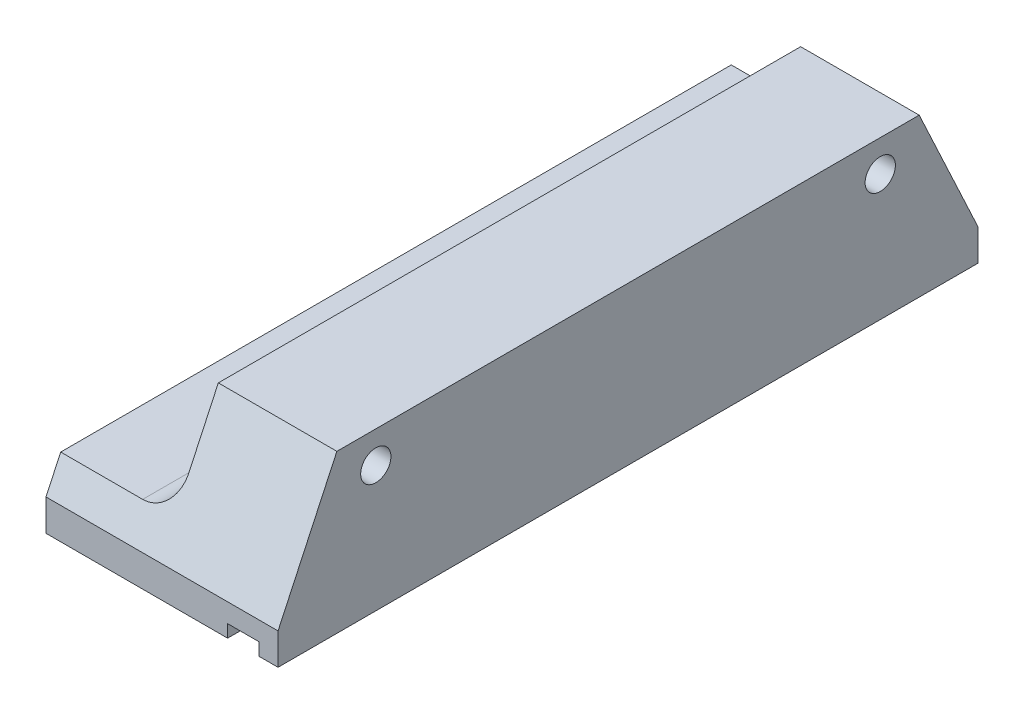
ISO-10303-21;
HEADER;
FILE_DESCRIPTION(('STEP AP214'),'2;1');
FILE_NAME('part.step','',(''),(''),'','','');
FILE_SCHEMA(('AUTOMOTIVE_DESIGN { 1 0 10303 214 1 1 1 1 }'));
ENDSEC;
DATA;
#1=APPLICATION_CONTEXT('core data for automotive mechanical design processes');
#2=APPLICATION_PROTOCOL_DEFINITION('international standard','automotive_design',2000,#1);
#3=PRODUCT_CONTEXT('',#1,'mechanical');
#4=PRODUCT('Part','Part','',(#3));
#5=PRODUCT_RELATED_PRODUCT_CATEGORY('part','',(#4));
#6=PRODUCT_DEFINITION_FORMATION('','',#4);
#7=PRODUCT_DEFINITION_CONTEXT('part definition',#1,'design');
#8=PRODUCT_DEFINITION('design','',#6,#7);
#9=PRODUCT_DEFINITION_SHAPE('','',#8);
#10=(LENGTH_UNIT() NAMED_UNIT(*) SI_UNIT(.MILLI.,.METRE.));
#11=(NAMED_UNIT(*) PLANE_ANGLE_UNIT() SI_UNIT($,.RADIAN.));
#12=(NAMED_UNIT(*) SI_UNIT($,.STERADIAN.) SOLID_ANGLE_UNIT());
#13=UNCERTAINTY_MEASURE_WITH_UNIT(LENGTH_MEASURE(1.E-05),#10,'distance_accuracy_value','');
#14=(GEOMETRIC_REPRESENTATION_CONTEXT(3) GLOBAL_UNCERTAINTY_ASSIGNED_CONTEXT((#13)) GLOBAL_UNIT_ASSIGNED_CONTEXT((#10,
#11,#12)) REPRESENTATION_CONTEXT('',''));
#15=CARTESIAN_POINT('',(0.,0.,0.));
#16=DIRECTION('',(0.,0.,1.));
#17=DIRECTION('',(1.,0.,0.));
#18=AXIS2_PLACEMENT_3D('',#15,#16,#17);
#19=CARTESIAN_POINT('',(0.,12.5,55.5));
#20=DIRECTION('',(0.,-1.,0.));
#21=DIRECTION('',(1.,0.,0.));
#22=AXIS2_PLACEMENT_3D('',#19,#20,#21);
#23=PLANE('',#22);
#24=DIRECTION('',(0.,0.,-1.));
#25=VECTOR('',#24,1.);
#26=CARTESIAN_POINT('',(-9.4,12.5,0.));
#27=LINE('',#26,#25);
#28=CARTESIAN_POINT('',(-9.4,12.5,50.83692341845));
#29=VERTEX_POINT('',#28);
#30=CARTESIAN_POINT('',(-9.4,12.5,4.66307658154998));
#31=VERTEX_POINT('',#30);
#32=EDGE_CURVE('E152',#29,#31,#27,.T.);
#33=ORIENTED_EDGE('',*,*,#32,.F.);
#34=DIRECTION('',(1.,0.,0.));
#35=VECTOR('',#34,1.);
#36=CARTESIAN_POINT('',(0.,12.5,50.83692341845));
#37=LINE('',#36,#35);
#38=CARTESIAN_POINT('',(0.,12.5,50.83692341845));
#39=VERTEX_POINT('',#38);
#40=EDGE_CURVE('E173',#29,#39,#37,.T.);
#41=ORIENTED_EDGE('',*,*,#40,.T.);
#42=DIRECTION('',(0.,0.,-1.));
#43=VECTOR('',#42,1.);
#44=CARTESIAN_POINT('',(0.,12.5,55.5));
#45=LINE('',#44,#43);
#46=CARTESIAN_POINT('',(0.,12.5,4.66307658154998));
#47=VERTEX_POINT('',#46);
#48=EDGE_CURVE('E163',#39,#47,#45,.T.);
#49=ORIENTED_EDGE('',*,*,#48,.T.);
#50=DIRECTION('',(-1.,0.,0.));
#51=VECTOR('',#50,1.);
#52=CARTESIAN_POINT('',(0.,12.5,4.66307658154998));
#53=LINE('',#52,#51);
#54=EDGE_CURVE('E158',#47,#31,#53,.T.);
#55=ORIENTED_EDGE('',*,*,#54,.T.);
#56=EDGE_LOOP('',(#33,#41,#49,#55));
#57=FACE_BOUND('',#56,.T.);
#58=ADVANCED_FACE('F35',(#57),#23,.F.);
#59=CARTESIAN_POINT('',(-18.4,9.99999999999999,7.75));
#60=DIRECTION('',(-1.,0.,0.));
#61=DIRECTION('',(0.,0.,1.));
#62=AXIS2_PLACEMENT_3D('',#59,#60,#61);
#63=CYLINDRICAL_SURFACE('',#62,2.19999999999999);
#64=CARTESIAN_POINT('',(-7.5,9.99999999999999,7.75));
#65=DIRECTION('',(-1.,0.,0.));
#66=DIRECTION('',(0.,0.,1.));
#67=AXIS2_PLACEMENT_3D('',#64,#65,#66);
#68=CIRCLE('',#67,2.2);
#69=CARTESIAN_POINT('',(-7.5,9.99999999999999,9.95));
#70=VERTEX_POINT('',#69);
#71=EDGE_CURVE('E296',#70,#70,#68,.T.);
#72=ORIENTED_EDGE('',*,*,#71,.F.);
#73=EDGE_LOOP('',(#72));
#74=FACE_BOUND('',#73,.T.);
#75=CARTESIAN_POINT('',(-9.4,9.99999999999999,7.75));
#76=DIRECTION('',(-1.,0.,0.));
#77=DIRECTION('',(0.,0.,1.));
#78=AXIS2_PLACEMENT_3D('',#75,#76,#77);
#79=CIRCLE('',#78,2.19999999999999);
#80=CARTESIAN_POINT('',(-9.4,9.99999999999999,9.94999999999999));
#81=VERTEX_POINT('',#80);
#82=EDGE_CURVE('E143',#81,#81,#79,.F.);
#83=ORIENTED_EDGE('',*,*,#82,.F.);
#84=EDGE_LOOP('',(#83));
#85=FACE_BOUND('',#84,.T.);
#86=ADVANCED_FACE('F319',(#74,#85),#63,.F.);
#87=CARTESIAN_POINT('',(-18.4,9.99999999999999,47.75));
#88=DIRECTION('',(-1.,0.,0.));
#89=DIRECTION('',(0.,0.,1.));
#90=AXIS2_PLACEMENT_3D('',#87,#88,#89);
#91=CYLINDRICAL_SURFACE('',#90,2.19999999999999);
#92=CARTESIAN_POINT('',(-7.5,9.99999999999999,47.75));
#93=DIRECTION('',(-1.,0.,0.));
#94=DIRECTION('',(0.,0.,1.));
#95=AXIS2_PLACEMENT_3D('',#92,#93,#94);
#96=CIRCLE('',#95,2.2);
#97=CARTESIAN_POINT('',(-7.5,9.99999999999999,49.95));
#98=VERTEX_POINT('',#97);
#99=EDGE_CURVE('E142',#98,#98,#96,.T.);
#100=ORIENTED_EDGE('',*,*,#99,.F.);
#101=EDGE_LOOP('',(#100));
#102=FACE_BOUND('',#101,.T.);
#103=CARTESIAN_POINT('',(-9.4,9.99999999999999,47.75));
#104=DIRECTION('',(-1.,0.,0.));
#105=DIRECTION('',(0.,0.,1.));
#106=AXIS2_PLACEMENT_3D('',#103,#104,#105);
#107=CIRCLE('',#106,2.19999999999999);
#108=CARTESIAN_POINT('',(-9.4,9.99999999999999,49.95));
#109=VERTEX_POINT('',#108);
#110=EDGE_CURVE('E309',#109,#109,#107,.F.);
#111=ORIENTED_EDGE('',*,*,#110,.F.);
#112=EDGE_LOOP('',(#111));
#113=FACE_BOUND('',#112,.T.);
#114=ADVANCED_FACE('F324',(#102,#113),#91,.F.);
#115=CARTESIAN_POINT('',(0.,0.,55.5));
#116=DIRECTION('',(0.,1.,0.));
#117=DIRECTION('',(-1.,0.,0.));
#118=AXIS2_PLACEMENT_3D('',#115,#116,#117);
#119=PLANE('',#118);
#120=DIRECTION('',(1.,0.,0.));
#121=VECTOR('',#120,1.);
#122=CARTESIAN_POINT('',(0.,0.,55.5));
#123=LINE('',#122,#121);
#124=CARTESIAN_POINT('',(-1.5,0.,55.5));
#125=VERTEX_POINT('',#124);
#126=CARTESIAN_POINT('',(0.,0.,55.5));
#127=VERTEX_POINT('',#126);
#128=EDGE_CURVE('E225',#125,#127,#123,.T.);
#129=ORIENTED_EDGE('',*,*,#128,.F.);
#130=DIRECTION('',(0.,0.,1.));
#131=VECTOR('',#130,1.);
#132=CARTESIAN_POINT('',(-1.5,0.,0.));
#133=LINE('',#132,#131);
#134=CARTESIAN_POINT('',(-1.5,0.,0.));
#135=VERTEX_POINT('',#134);
#136=EDGE_CURVE('E222',#135,#125,#133,.T.);
#137=ORIENTED_EDGE('',*,*,#136,.F.);
#138=DIRECTION('',(1.,0.,0.));
#139=VECTOR('',#138,1.);
#140=CARTESIAN_POINT('',(0.,0.,0.));
#141=LINE('',#140,#139);
#142=CARTESIAN_POINT('',(0.,0.,0.));
#143=VERTEX_POINT('',#142);
#144=EDGE_CURVE('E217',#135,#143,#141,.T.);
#145=ORIENTED_EDGE('',*,*,#144,.T.);
#146=DIRECTION('',(0.,0.,-1.));
#147=VECTOR('',#146,1.);
#148=CARTESIAN_POINT('',(0.,0.,55.5));
#149=LINE('',#148,#147);
#150=EDGE_CURVE('E207',#127,#143,#149,.T.);
#151=ORIENTED_EDGE('',*,*,#150,.F.);
#152=EDGE_LOOP('',(#129,#137,#145,#151));
#153=FACE_BOUND('',#152,.T.);
#154=ADVANCED_FACE('F332',(#153),#119,.F.);
#155=CARTESIAN_POINT('',(0.,0.,55.5));
#156=DIRECTION('',(-1.,0.,0.));
#157=DIRECTION('',(0.,0.,1.));
#158=AXIS2_PLACEMENT_3D('',#155,#156,#157);
#159=PLANE('',#158);
#160=CARTESIAN_POINT('',(0.,9.99999999999999,47.75));
#161=DIRECTION('',(-1.,0.,0.));
#162=DIRECTION('',(0.,0.,1.));
#163=AXIS2_PLACEMENT_3D('',#160,#161,#162);
#164=CIRCLE('',#163,1.2);
#165=CARTESIAN_POINT('',(0.,9.99999999999999,48.95));
#166=VERTEX_POINT('',#165);
#167=EDGE_CURVE('E299',#166,#166,#164,.T.);
#168=ORIENTED_EDGE('',*,*,#167,.T.);
#169=EDGE_LOOP('',(#168));
#170=FACE_BOUND('',#169,.T.);
#171=CARTESIAN_POINT('',(0.,9.99999999999999,7.75));
#172=DIRECTION('',(-1.,0.,0.));
#173=DIRECTION('',(0.,0.,1.));
#174=AXIS2_PLACEMENT_3D('',#171,#172,#173);
#175=CIRCLE('',#174,1.2);
#176=CARTESIAN_POINT('',(0.,9.99999999999999,8.95));
#177=VERTEX_POINT('',#176);
#178=EDGE_CURVE('E290',#177,#177,#175,.T.);
#179=ORIENTED_EDGE('',*,*,#178,.T.);
#180=EDGE_LOOP('',(#179));
#181=FACE_BOUND('',#180,.T.);
#182=ORIENTED_EDGE('',*,*,#48,.F.);
#183=DIRECTION('',(0.,-0.906307787036651,0.422618261740697));
#184=VECTOR('',#183,1.);
#185=CARTESIAN_POINT('',(0.,2.49999999999993,55.5));
#186=LINE('',#185,#184);
#187=CARTESIAN_POINT('',(0.,2.49999999999993,55.5));
#188=VERTEX_POINT('',#187);
#189=EDGE_CURVE('E175',#39,#188,#186,.T.);
#190=ORIENTED_EDGE('',*,*,#189,.T.);
#191=DIRECTION('',(0.,1.,0.));
#192=VECTOR('',#191,1.);
#193=CARTESIAN_POINT('',(0.,0.,55.5));
#194=LINE('',#193,#192);
#195=EDGE_CURVE('E216',#127,#188,#194,.T.);
#196=ORIENTED_EDGE('',*,*,#195,.F.);
#197=ORIENTED_EDGE('',*,*,#150,.T.);
#198=DIRECTION('',(0.,1.,0.));
#199=VECTOR('',#198,1.);
#200=CARTESIAN_POINT('',(0.,0.,0.));
#201=LINE('',#200,#199);
#202=CARTESIAN_POINT('',(0.,2.49999999999992,0.));
#203=VERTEX_POINT('',#202);
#204=EDGE_CURVE('E220',#143,#203,#201,.T.);
#205=ORIENTED_EDGE('',*,*,#204,.T.);
#206=DIRECTION('',(0.,-0.906307787036651,-0.422618261740697));
#207=VECTOR('',#206,1.);
#208=CARTESIAN_POINT('',(0.,12.5,4.66307658154998));
#209=LINE('',#208,#207);
#210=EDGE_CURVE('E160',#203,#47,#209,.F.);
#211=ORIENTED_EDGE('',*,*,#210,.T.);
#212=EDGE_LOOP('',(#182,#190,#196,#197,#205,#211));
#213=FACE_BOUND('',#212,.T.);
#214=ADVANCED_FACE('F200',(#170,#181,#213),#159,.F.);
#215=CARTESIAN_POINT('',(-18.4,0.,55.5));
#216=DIRECTION('',(1.,0.,0.));
#217=DIRECTION('',(0.,0.,-1.));
#218=AXIS2_PLACEMENT_3D('',#215,#216,#217);
#219=PLANE('',#218);
#220=CARTESIAN_POINT('',(-18.4,3.,51.75));
#221=DIRECTION('',(-1.,0.,0.));
#222=DIRECTION('',(0.,0.,1.));
#223=AXIS2_PLACEMENT_3D('',#220,#221,#222);
#224=CIRCLE('',#223,1.);
#225=CARTESIAN_POINT('',(-18.4,3.,52.75));
#226=VERTEX_POINT('',#225);
#227=EDGE_CURVE('E287',#226,#226,#224,.T.);
#228=ORIENTED_EDGE('',*,*,#227,.F.);
#229=EDGE_LOOP('',(#228));
#230=FACE_BOUND('',#229,.T.);
#231=CARTESIAN_POINT('',(-18.4,3.,27.75));
#232=DIRECTION('',(-1.,0.,0.));
#233=DIRECTION('',(0.,0.,1.));
#234=AXIS2_PLACEMENT_3D('',#231,#232,#233);
#235=CIRCLE('',#234,1.);
#236=CARTESIAN_POINT('',(-18.4,3.,28.75));
#237=VERTEX_POINT('',#236);
#238=EDGE_CURVE('E275',#237,#237,#235,.T.);
#239=ORIENTED_EDGE('',*,*,#238,.F.);
#240=EDGE_LOOP('',(#239));
#241=FACE_BOUND('',#240,.T.);
#242=CARTESIAN_POINT('',(-18.4,3.,3.75));
#243=DIRECTION('',(-1.,0.,0.));
#244=DIRECTION('',(0.,0.,1.));
#245=AXIS2_PLACEMENT_3D('',#242,#243,#244);
#246=CIRCLE('',#245,0.999999999999999);
#247=CARTESIAN_POINT('',(-18.4,3.,4.75));
#248=VERTEX_POINT('',#247);
#249=EDGE_CURVE('E263',#248,#248,#246,.T.);
#250=ORIENTED_EDGE('',*,*,#249,.F.);
#251=EDGE_LOOP('',(#250));
#252=FACE_BOUND('',#251,.T.);
#253=DIRECTION('',(0.,0.906307787036651,-0.422618261740697));
#254=VECTOR('',#253,1.);
#255=CARTESIAN_POINT('',(-18.4,2.49999999999993,55.5));
#256=LINE('',#255,#254);
#257=CARTESIAN_POINT('',(-18.4,2.49999999999993,55.5));
#258=VERTEX_POINT('',#257);
#259=CARTESIAN_POINT('',(-18.4,5.,54.3342308546125));
#260=VERTEX_POINT('',#259);
#261=EDGE_CURVE('E151',#258,#260,#256,.T.);
#262=ORIENTED_EDGE('',*,*,#261,.T.);
#263=DIRECTION('',(0.,0.,1.));
#264=VECTOR('',#263,1.);
#265=CARTESIAN_POINT('',(-18.4,4.99999999999999,0.));
#266=LINE('',#265,#264);
#267=CARTESIAN_POINT('',(-18.4,4.99999999999999,1.16576914538752));
#268=VERTEX_POINT('',#267);
#269=EDGE_CURVE('E138',#268,#260,#266,.T.);
#270=ORIENTED_EDGE('',*,*,#269,.F.);
#271=DIRECTION('',(0.,0.906307787036651,0.422618261740697));
#272=VECTOR('',#271,1.);
#273=CARTESIAN_POINT('',(-18.4,12.5,4.66307658154998));
#274=LINE('',#273,#272);
#275=CARTESIAN_POINT('',(-18.4,2.49999999999992,0.));
#276=VERTEX_POINT('',#275);
#277=EDGE_CURVE('E148',#268,#276,#274,.F.);
#278=ORIENTED_EDGE('',*,*,#277,.T.);
#279=DIRECTION('',(0.,-1.,0.));
#280=VECTOR('',#279,1.);
#281=CARTESIAN_POINT('',(-18.4,0.,0.));
#282=LINE('',#281,#280);
#283=CARTESIAN_POINT('',(-18.4,0.,0.));
#284=VERTEX_POINT('',#283);
#285=EDGE_CURVE('E218',#276,#284,#282,.T.);
#286=ORIENTED_EDGE('',*,*,#285,.T.);
#287=DIRECTION('',(0.,0.,-1.));
#288=VECTOR('',#287,1.);
#289=CARTESIAN_POINT('',(-18.4,0.,55.5));
#290=LINE('',#289,#288);
#291=CARTESIAN_POINT('',(-18.4,0.,55.5));
#292=VERTEX_POINT('',#291);
#293=EDGE_CURVE('E205',#292,#284,#290,.T.);
#294=ORIENTED_EDGE('',*,*,#293,.F.);
#295=DIRECTION('',(0.,-1.,0.));
#296=VECTOR('',#295,1.);
#297=CARTESIAN_POINT('',(-18.4,0.,55.5));
#298=LINE('',#297,#296);
#299=EDGE_CURVE('E226',#258,#292,#298,.T.);
#300=ORIENTED_EDGE('',*,*,#299,.F.);
#301=EDGE_LOOP('',(#262,#270,#278,#286,#294,#300));
#302=FACE_BOUND('',#301,.T.);
#303=ADVANCED_FACE('F147',(#230,#241,#252,#302),#219,.F.);
#304=CARTESIAN_POINT('',(-4.,0.,0.));
#305=VERTEX_POINT('',#304);
#306=EDGE_CURVE('E213',#284,#305,#141,.T.);
#307=ORIENTED_EDGE('',*,*,#306,.T.);
#308=DIRECTION('',(0.,0.,1.));
#309=VECTOR('',#308,1.);
#310=CARTESIAN_POINT('',(-4.,0.,0.));
#311=LINE('',#310,#309);
#312=CARTESIAN_POINT('',(-4.,0.,55.5));
#313=VERTEX_POINT('',#312);
#314=EDGE_CURVE('E234',#305,#313,#311,.T.);
#315=ORIENTED_EDGE('',*,*,#314,.T.);
#316=EDGE_CURVE('E212',#292,#313,#123,.T.);
#317=ORIENTED_EDGE('',*,*,#316,.F.);
#318=ORIENTED_EDGE('',*,*,#293,.T.);
#319=EDGE_LOOP('',(#307,#315,#317,#318));
#320=FACE_BOUND('',#319,.T.);
#321=ADVANCED_FACE('F427',(#320),#119,.F.);
#322=CARTESIAN_POINT('',(0.,0.,55.5));
#323=DIRECTION('',(0.,0.,1.));
#324=DIRECTION('',(1.,0.,0.));
#325=AXIS2_PLACEMENT_3D('',#322,#323,#324);
#326=PLANE('',#325);
#327=ORIENTED_EDGE('',*,*,#195,.T.);
#328=DIRECTION('',(-1.,0.,0.));
#329=VECTOR('',#328,1.);
#330=CARTESIAN_POINT('',(-18.4,2.49999999999993,55.5));
#331=LINE('',#330,#329);
#332=EDGE_CURVE('E169',#188,#258,#331,.T.);
#333=ORIENTED_EDGE('',*,*,#332,.T.);
#334=ORIENTED_EDGE('',*,*,#299,.T.);
#335=ORIENTED_EDGE('',*,*,#316,.T.);
#336=DIRECTION('',(0.,-1.,0.));
#337=VECTOR('',#336,1.);
#338=CARTESIAN_POINT('',(-4.,0.,55.5));
#339=LINE('',#338,#337);
#340=CARTESIAN_POINT('',(-4.,1.,55.5));
#341=VERTEX_POINT('',#340);
#342=EDGE_CURVE('E238',#341,#313,#339,.T.);
#343=ORIENTED_EDGE('',*,*,#342,.F.);
#344=DIRECTION('',(-1.,0.,0.));
#345=VECTOR('',#344,1.);
#346=CARTESIAN_POINT('',(-1.5,1.,55.5));
#347=LINE('',#346,#345);
#348=CARTESIAN_POINT('',(-1.5,1.,55.5));
#349=VERTEX_POINT('',#348);
#350=EDGE_CURVE('E241',#349,#341,#347,.T.);
#351=ORIENTED_EDGE('',*,*,#350,.F.);
#352=DIRECTION('',(0.,1.,0.));
#353=VECTOR('',#352,1.);
#354=CARTESIAN_POINT('',(-1.5,0.,55.5));
#355=LINE('',#354,#353);
#356=EDGE_CURVE('E244',#125,#349,#355,.T.);
#357=ORIENTED_EDGE('',*,*,#356,.F.);
#358=ORIENTED_EDGE('',*,*,#128,.T.);
#359=EDGE_LOOP('',(#327,#333,#334,#335,#343,#351,#357,#358));
#360=FACE_BOUND('',#359,.T.);
#361=ADVANCED_FACE('F424',(#360),#326,.T.);
#362=CARTESIAN_POINT('',(0.,0.,0.));
#363=DIRECTION('',(0.,0.,1.));
#364=DIRECTION('',(1.,0.,0.));
#365=AXIS2_PLACEMENT_3D('',#362,#363,#364);
#366=PLANE('',#365);
#367=ORIENTED_EDGE('',*,*,#285,.F.);
#368=DIRECTION('',(1.,0.,0.));
#369=VECTOR('',#368,1.);
#370=CARTESIAN_POINT('',(0.,2.49999999999992,0.));
#371=LINE('',#370,#369);
#372=EDGE_CURVE('E157',#276,#203,#371,.T.);
#373=ORIENTED_EDGE('',*,*,#372,.T.);
#374=ORIENTED_EDGE('',*,*,#204,.F.);
#375=ORIENTED_EDGE('',*,*,#144,.F.);
#376=DIRECTION('',(0.,1.,0.));
#377=VECTOR('',#376,1.);
#378=CARTESIAN_POINT('',(-1.5,0.,0.));
#379=LINE('',#378,#377);
#380=CARTESIAN_POINT('',(-1.5,1.,0.));
#381=VERTEX_POINT('',#380);
#382=EDGE_CURVE('E240',#135,#381,#379,.T.);
#383=ORIENTED_EDGE('',*,*,#382,.T.);
#384=DIRECTION('',(-1.,0.,0.));
#385=VECTOR('',#384,1.);
#386=CARTESIAN_POINT('',(-1.5,1.,0.));
#387=LINE('',#386,#385);
#388=CARTESIAN_POINT('',(-4.,1.,0.));
#389=VERTEX_POINT('',#388);
#390=EDGE_CURVE('E250',#381,#389,#387,.T.);
#391=ORIENTED_EDGE('',*,*,#390,.T.);
#392=DIRECTION('',(0.,-1.,0.));
#393=VECTOR('',#392,1.);
#394=CARTESIAN_POINT('',(-4.,0.,0.));
#395=LINE('',#394,#393);
#396=EDGE_CURVE('E232',#389,#305,#395,.T.);
#397=ORIENTED_EDGE('',*,*,#396,.T.);
#398=ORIENTED_EDGE('',*,*,#306,.F.);
#399=EDGE_LOOP('',(#367,#373,#374,#375,#383,#391,#397,#398));
#400=FACE_BOUND('',#399,.T.);
#401=ADVANCED_FACE('F422',(#400),#366,.F.);
#402=CARTESIAN_POINT('',(-1.5,0.,0.));
#403=DIRECTION('',(1.,0.,0.));
#404=DIRECTION('',(0.,1.,0.));
#405=AXIS2_PLACEMENT_3D('',#402,#403,#404);
#406=PLANE('',#405);
#407=ORIENTED_EDGE('',*,*,#356,.T.);
#408=DIRECTION('',(0.,0.,1.));
#409=VECTOR('',#408,1.);
#410=CARTESIAN_POINT('',(-1.5,1.,0.));
#411=LINE('',#410,#409);
#412=EDGE_CURVE('E229',#381,#349,#411,.T.);
#413=ORIENTED_EDGE('',*,*,#412,.F.);
#414=ORIENTED_EDGE('',*,*,#382,.F.);
#415=ORIENTED_EDGE('',*,*,#136,.T.);
#416=EDGE_LOOP('',(#407,#413,#414,#415));
#417=FACE_BOUND('',#416,.T.);
#418=ADVANCED_FACE('F415',(#417),#406,.F.);
#419=CARTESIAN_POINT('',(-4.,0.,0.));
#420=DIRECTION('',(-1.,0.,0.));
#421=DIRECTION('',(0.,0.,1.));
#422=AXIS2_PLACEMENT_3D('',#419,#420,#421);
#423=PLANE('',#422);
#424=ORIENTED_EDGE('',*,*,#342,.T.);
#425=ORIENTED_EDGE('',*,*,#314,.F.);
#426=ORIENTED_EDGE('',*,*,#396,.F.);
#427=DIRECTION('',(0.,0.,1.));
#428=VECTOR('',#427,1.);
#429=CARTESIAN_POINT('',(-4.,1.,0.));
#430=LINE('',#429,#428);
#431=EDGE_CURVE('E231',#389,#341,#430,.T.);
#432=ORIENTED_EDGE('',*,*,#431,.T.);
#433=EDGE_LOOP('',(#424,#425,#426,#432));
#434=FACE_BOUND('',#433,.T.);
#435=ADVANCED_FACE('F412',(#434),#423,.F.);
#436=CARTESIAN_POINT('',(-1.5,1.,0.));
#437=DIRECTION('',(0.,1.,0.));
#438=DIRECTION('',(-1.,0.,0.));
#439=AXIS2_PLACEMENT_3D('',#436,#437,#438);
#440=PLANE('',#439);
#441=ORIENTED_EDGE('',*,*,#350,.T.);
#442=ORIENTED_EDGE('',*,*,#431,.F.);
#443=ORIENTED_EDGE('',*,*,#390,.F.);
#444=ORIENTED_EDGE('',*,*,#412,.T.);
#445=EDGE_LOOP('',(#441,#442,#443,#444));
#446=FACE_BOUND('',#445,.T.);
#447=ADVANCED_FACE('F410',(#446),#440,.F.);
#448=CARTESIAN_POINT('',(-11.9,3.,3.75));
#449=DIRECTION('',(-1.,0.,0.));
#450=DIRECTION('',(0.,0.,1.));
#451=AXIS2_PLACEMENT_3D('',#448,#449,#450);
#452=CONICAL_SURFACE('',#451,0.799999999999999,1.02974425867665);
#453=CARTESIAN_POINT('',(-11.4193115047779,3.,3.75));
#454=VERTEX_POINT('',#453);
#455=VERTEX_LOOP('',#454);
#456=FACE_BOUND('',#455,.T.);
#457=CARTESIAN_POINT('',(-11.9,3.,3.75));
#458=DIRECTION('',(-1.,0.,0.));
#459=DIRECTION('',(0.,0.,1.));
#460=AXIS2_PLACEMENT_3D('',#457,#458,#459);
#461=CIRCLE('',#460,0.799999999999999);
#462=CARTESIAN_POINT('',(-11.9,3.,4.55));
#463=VERTEX_POINT('',#462);
#464=EDGE_CURVE('E247',#463,#463,#461,.T.);
#465=ORIENTED_EDGE('',*,*,#464,.T.);
#466=EDGE_LOOP('',(#465));
#467=FACE_BOUND('',#466,.T.);
#468=ADVANCED_FACE('F406',(#456,#467),#452,.F.);
#469=CARTESIAN_POINT('',(-18.4,3.,3.75));
#470=DIRECTION('',(-1.,0.,0.));
#471=DIRECTION('',(0.,0.,1.));
#472=AXIS2_PLACEMENT_3D('',#469,#470,#471);
#473=CYLINDRICAL_SURFACE('',#472,0.799999999999999);
#474=ORIENTED_EDGE('',*,*,#464,.F.);
#475=EDGE_LOOP('',(#474));
#476=FACE_BOUND('',#475,.T.);
#477=CARTESIAN_POINT('',(-13.9,3.,3.75));
#478=DIRECTION('',(-1.,0.,0.));
#479=DIRECTION('',(0.,0.,1.));
#480=AXIS2_PLACEMENT_3D('',#477,#478,#479);
#481=CIRCLE('',#480,0.799999999999999);
#482=CARTESIAN_POINT('',(-13.9,3.,4.55));
#483=VERTEX_POINT('',#482);
#484=EDGE_CURVE('E257',#483,#483,#481,.T.);
#485=ORIENTED_EDGE('',*,*,#484,.T.);
#486=EDGE_LOOP('',(#485));
#487=FACE_BOUND('',#486,.T.);
#488=ADVANCED_FACE('F402',(#476,#487),#473,.F.);
#489=CARTESIAN_POINT('',(-13.9,3.8,3.75));
#490=DIRECTION('',(1.,0.,0.));
#491=DIRECTION('',(0.,0.,-1.));
#492=AXIS2_PLACEMENT_3D('',#489,#490,#491);
#493=PLANE('',#492);
#494=ORIENTED_EDGE('',*,*,#484,.F.);
#495=EDGE_LOOP('',(#494));
#496=FACE_BOUND('',#495,.T.);
#497=CARTESIAN_POINT('',(-13.9,3.,3.75));
#498=DIRECTION('',(-1.,0.,0.));
#499=DIRECTION('',(0.,0.,1.));
#500=AXIS2_PLACEMENT_3D('',#497,#498,#499);
#501=CIRCLE('',#500,0.999999999999999);
#502=CARTESIAN_POINT('',(-13.9,3.,4.75));
#503=VERTEX_POINT('',#502);
#504=EDGE_CURVE('E260',#503,#503,#501,.T.);
#505=ORIENTED_EDGE('',*,*,#504,.T.);
#506=EDGE_LOOP('',(#505));
#507=FACE_BOUND('',#506,.T.);
#508=ADVANCED_FACE('F398',(#496,#507),#493,.F.);
#509=CARTESIAN_POINT('',(-18.4,3.,3.75));
#510=DIRECTION('',(-1.,0.,0.));
#511=DIRECTION('',(0.,0.,1.));
#512=AXIS2_PLACEMENT_3D('',#509,#510,#511);
#513=CYLINDRICAL_SURFACE('',#512,0.999999999999999);
#514=ORIENTED_EDGE('',*,*,#504,.F.);
#515=EDGE_LOOP('',(#514));
#516=FACE_BOUND('',#515,.T.);
#517=ORIENTED_EDGE('',*,*,#249,.T.);
#518=EDGE_LOOP('',(#517));
#519=FACE_BOUND('',#518,.T.);
#520=ADVANCED_FACE('F394',(#516,#519),#513,.F.);
#521=CARTESIAN_POINT('',(-11.9,3.,27.75));
#522=DIRECTION('',(-1.,0.,0.));
#523=DIRECTION('',(0.,0.,1.));
#524=AXIS2_PLACEMENT_3D('',#521,#522,#523);
#525=CONICAL_SURFACE('',#524,0.799999999999998,1.02974425867665);
#526=CARTESIAN_POINT('',(-11.4193115047779,3.,27.75));
#527=VERTEX_POINT('',#526);
#528=VERTEX_LOOP('',#527);
#529=FACE_BOUND('',#528,.T.);
#530=CARTESIAN_POINT('',(-11.9,3.,27.75));
#531=DIRECTION('',(-1.,0.,0.));
#532=DIRECTION('',(0.,0.,1.));
#533=AXIS2_PLACEMENT_3D('',#530,#531,#532);
#534=CIRCLE('',#533,0.799999999999998);
#535=CARTESIAN_POINT('',(-11.9,3.,28.55));
#536=VERTEX_POINT('',#535);
#537=EDGE_CURVE('E266',#536,#536,#534,.T.);
#538=ORIENTED_EDGE('',*,*,#537,.T.);
#539=EDGE_LOOP('',(#538));
#540=FACE_BOUND('',#539,.T.);
#541=ADVANCED_FACE('F390',(#529,#540),#525,.F.);
#542=CARTESIAN_POINT('',(-18.4,3.,27.75));
#543=DIRECTION('',(-1.,0.,0.));
#544=DIRECTION('',(0.,0.,1.));
#545=AXIS2_PLACEMENT_3D('',#542,#543,#544);
#546=CYLINDRICAL_SURFACE('',#545,0.799999999999998);
#547=ORIENTED_EDGE('',*,*,#537,.F.);
#548=EDGE_LOOP('',(#547));
#549=FACE_BOUND('',#548,.T.);
#550=CARTESIAN_POINT('',(-13.9,3.,27.75));
#551=DIRECTION('',(-1.,0.,0.));
#552=DIRECTION('',(0.,0.,1.));
#553=AXIS2_PLACEMENT_3D('',#550,#551,#552);
#554=CIRCLE('',#553,0.799999999999999);
#555=CARTESIAN_POINT('',(-13.9,3.,28.55));
#556=VERTEX_POINT('',#555);
#557=EDGE_CURVE('E269',#556,#556,#554,.T.);
#558=ORIENTED_EDGE('',*,*,#557,.T.);
#559=EDGE_LOOP('',(#558));
#560=FACE_BOUND('',#559,.T.);
#561=ADVANCED_FACE('F386',(#549,#560),#546,.F.);
#562=CARTESIAN_POINT('',(-13.9,3.8,27.75));
#563=DIRECTION('',(1.,0.,0.));
#564=DIRECTION('',(0.,0.,-1.));
#565=AXIS2_PLACEMENT_3D('',#562,#563,#564);
#566=PLANE('',#565);
#567=ORIENTED_EDGE('',*,*,#557,.F.);
#568=EDGE_LOOP('',(#567));
#569=FACE_BOUND('',#568,.T.);
#570=CARTESIAN_POINT('',(-13.9,3.,27.75));
#571=DIRECTION('',(-1.,0.,0.));
#572=DIRECTION('',(0.,0.,1.));
#573=AXIS2_PLACEMENT_3D('',#570,#571,#572);
#574=CIRCLE('',#573,0.999999999999999);
#575=CARTESIAN_POINT('',(-13.9,3.,28.75));
#576=VERTEX_POINT('',#575);
#577=EDGE_CURVE('E272',#576,#576,#574,.T.);
#578=ORIENTED_EDGE('',*,*,#577,.T.);
#579=EDGE_LOOP('',(#578));
#580=FACE_BOUND('',#579,.T.);
#581=ADVANCED_FACE('F382',(#569,#580),#566,.F.);
#582=CARTESIAN_POINT('',(-18.4,3.,27.75));
#583=DIRECTION('',(-1.,0.,0.));
#584=DIRECTION('',(0.,0.,1.));
#585=AXIS2_PLACEMENT_3D('',#582,#583,#584);
#586=CYLINDRICAL_SURFACE('',#585,0.999999999999999);
#587=ORIENTED_EDGE('',*,*,#577,.F.);
#588=EDGE_LOOP('',(#587));
#589=FACE_BOUND('',#588,.T.);
#590=ORIENTED_EDGE('',*,*,#238,.T.);
#591=EDGE_LOOP('',(#590));
#592=FACE_BOUND('',#591,.T.);
#593=ADVANCED_FACE('F378',(#589,#592),#586,.F.);
#594=CARTESIAN_POINT('',(-11.9,3.,51.75));
#595=DIRECTION('',(-1.,0.,0.));
#596=DIRECTION('',(0.,0.,1.));
#597=AXIS2_PLACEMENT_3D('',#594,#595,#596);
#598=CONICAL_SURFACE('',#597,0.799999999999998,1.02974425867665);
#599=CARTESIAN_POINT('',(-11.4193115047779,3.,51.75));
#600=VERTEX_POINT('',#599);
#601=VERTEX_LOOP('',#600);
#602=FACE_BOUND('',#601,.T.);
#603=CARTESIAN_POINT('',(-11.9,3.,51.75));
#604=DIRECTION('',(-1.,0.,0.));
#605=DIRECTION('',(0.,0.,1.));
#606=AXIS2_PLACEMENT_3D('',#603,#604,#605);
#607=CIRCLE('',#606,0.799999999999998);
#608=CARTESIAN_POINT('',(-11.9,3.,52.55));
#609=VERTEX_POINT('',#608);
#610=EDGE_CURVE('E278',#609,#609,#607,.T.);
#611=ORIENTED_EDGE('',*,*,#610,.T.);
#612=EDGE_LOOP('',(#611));
#613=FACE_BOUND('',#612,.T.);
#614=ADVANCED_FACE('F374',(#602,#613),#598,.F.);
#615=CARTESIAN_POINT('',(-18.4,3.,51.75));
#616=DIRECTION('',(-1.,0.,0.));
#617=DIRECTION('',(0.,0.,1.));
#618=AXIS2_PLACEMENT_3D('',#615,#616,#617);
#619=CYLINDRICAL_SURFACE('',#618,0.799999999999998);
#620=ORIENTED_EDGE('',*,*,#610,.F.);
#621=EDGE_LOOP('',(#620));
#622=FACE_BOUND('',#621,.T.);
#623=CARTESIAN_POINT('',(-13.9,3.,51.75));
#624=DIRECTION('',(-1.,0.,0.));
#625=DIRECTION('',(0.,0.,1.));
#626=AXIS2_PLACEMENT_3D('',#623,#624,#625);
#627=CIRCLE('',#626,0.799999999999999);
#628=CARTESIAN_POINT('',(-13.9,3.,52.55));
#629=VERTEX_POINT('',#628);
#630=EDGE_CURVE('E281',#629,#629,#627,.T.);
#631=ORIENTED_EDGE('',*,*,#630,.T.);
#632=EDGE_LOOP('',(#631));
#633=FACE_BOUND('',#632,.T.);
#634=ADVANCED_FACE('F370',(#622,#633),#619,.F.);
#635=CARTESIAN_POINT('',(-13.9,3.8,51.75));
#636=DIRECTION('',(1.,0.,0.));
#637=DIRECTION('',(0.,0.,-1.));
#638=AXIS2_PLACEMENT_3D('',#635,#636,#637);
#639=PLANE('',#638);
#640=ORIENTED_EDGE('',*,*,#630,.F.);
#641=EDGE_LOOP('',(#640));
#642=FACE_BOUND('',#641,.T.);
#643=CARTESIAN_POINT('',(-13.9,3.,51.75));
#644=DIRECTION('',(-1.,0.,0.));
#645=DIRECTION('',(0.,0.,1.));
#646=AXIS2_PLACEMENT_3D('',#643,#644,#645);
#647=CIRCLE('',#646,0.999999999999999);
#648=CARTESIAN_POINT('',(-13.9,3.,52.75));
#649=VERTEX_POINT('',#648);
#650=EDGE_CURVE('E284',#649,#649,#647,.T.);
#651=ORIENTED_EDGE('',*,*,#650,.T.);
#652=EDGE_LOOP('',(#651));
#653=FACE_BOUND('',#652,.T.);
#654=ADVANCED_FACE('F366',(#642,#653),#639,.F.);
#655=CARTESIAN_POINT('',(-18.4,3.,51.75));
#656=DIRECTION('',(-1.,0.,0.));
#657=DIRECTION('',(0.,0.,1.));
#658=AXIS2_PLACEMENT_3D('',#655,#656,#657);
#659=CYLINDRICAL_SURFACE('',#658,0.999999999999999);
#660=ORIENTED_EDGE('',*,*,#650,.F.);
#661=EDGE_LOOP('',(#660));
#662=FACE_BOUND('',#661,.T.);
#663=ORIENTED_EDGE('',*,*,#227,.T.);
#664=EDGE_LOOP('',(#663));
#665=FACE_BOUND('',#664,.T.);
#666=ADVANCED_FACE('F362',(#662,#665),#659,.F.);
#667=CARTESIAN_POINT('',(-18.4,9.99999999999999,7.75));
#668=DIRECTION('',(-1.,0.,0.));
#669=DIRECTION('',(0.,0.,1.));
#670=AXIS2_PLACEMENT_3D('',#667,#668,#669);
#671=CYLINDRICAL_SURFACE('',#670,1.2);
#672=ORIENTED_EDGE('',*,*,#178,.F.);
#673=EDGE_LOOP('',(#672));
#674=FACE_BOUND('',#673,.T.);
#675=CARTESIAN_POINT('',(-7.5,9.99999999999999,7.75));
#676=DIRECTION('',(-1.,0.,0.));
#677=DIRECTION('',(0.,0.,1.));
#678=AXIS2_PLACEMENT_3D('',#675,#676,#677);
#679=CIRCLE('',#678,1.2);
#680=CARTESIAN_POINT('',(-7.5,9.99999999999999,8.95));
#681=VERTEX_POINT('',#680);
#682=EDGE_CURVE('E293',#681,#681,#679,.T.);
#683=ORIENTED_EDGE('',*,*,#682,.T.);
#684=EDGE_LOOP('',(#683));
#685=FACE_BOUND('',#684,.T.);
#686=ADVANCED_FACE('F358',(#674,#685),#671,.F.);
#687=CARTESIAN_POINT('',(-7.5,11.2,7.75));
#688=DIRECTION('',(1.,0.,0.));
#689=DIRECTION('',(0.,0.,-1.));
#690=AXIS2_PLACEMENT_3D('',#687,#688,#689);
#691=PLANE('',#690);
#692=ORIENTED_EDGE('',*,*,#682,.F.);
#693=EDGE_LOOP('',(#692));
#694=FACE_BOUND('',#693,.T.);
#695=ORIENTED_EDGE('',*,*,#71,.T.);
#696=EDGE_LOOP('',(#695));
#697=FACE_BOUND('',#696,.T.);
#698=ADVANCED_FACE('F353',(#694,#697),#691,.F.);
#699=CARTESIAN_POINT('',(-18.4,9.99999999999999,47.75));
#700=DIRECTION('',(-1.,0.,0.));
#701=DIRECTION('',(0.,0.,1.));
#702=AXIS2_PLACEMENT_3D('',#699,#700,#701);
#703=CYLINDRICAL_SURFACE('',#702,1.2);
#704=ORIENTED_EDGE('',*,*,#167,.F.);
#705=EDGE_LOOP('',(#704));
#706=FACE_BOUND('',#705,.T.);
#707=CARTESIAN_POINT('',(-7.5,9.99999999999999,47.75));
#708=DIRECTION('',(-1.,0.,0.));
#709=DIRECTION('',(0.,0.,1.));
#710=AXIS2_PLACEMENT_3D('',#707,#708,#709);
#711=CIRCLE('',#710,1.2);
#712=CARTESIAN_POINT('',(-7.5,9.99999999999999,48.95));
#713=VERTEX_POINT('',#712);
#714=EDGE_CURVE('E302',#713,#713,#711,.T.);
#715=ORIENTED_EDGE('',*,*,#714,.T.);
#716=EDGE_LOOP('',(#715));
#717=FACE_BOUND('',#716,.T.);
#718=ADVANCED_FACE('F350',(#706,#717),#703,.F.);
#719=CARTESIAN_POINT('',(-7.5,11.2,47.75));
#720=DIRECTION('',(1.,0.,0.));
#721=DIRECTION('',(0.,0.,-1.));
#722=AXIS2_PLACEMENT_3D('',#719,#720,#721);
#723=PLANE('',#722);
#724=ORIENTED_EDGE('',*,*,#714,.F.);
#725=EDGE_LOOP('',(#724));
#726=FACE_BOUND('',#725,.T.);
#727=ORIENTED_EDGE('',*,*,#99,.T.);
#728=EDGE_LOOP('',(#727));
#729=FACE_BOUND('',#728,.T.);
#730=ADVANCED_FACE('F335',(#726,#729),#723,.F.);
#731=CARTESIAN_POINT('',(0.,12.5,4.66307658154998));
#732=DIRECTION('',(0.,-0.422618261740697,0.906307787036651));
#733=DIRECTION('',(-1.,0.,0.));
#734=AXIS2_PLACEMENT_3D('',#731,#732,#733);
#735=PLANE('',#734);
#736=DIRECTION('',(1.,0.,0.));
#737=VECTOR('',#736,1.);
#738=CARTESIAN_POINT('',(0.,4.99999999999999,1.16576914538752));
#739=LINE('',#738,#737);
#740=CARTESIAN_POINT('',(-11.9,4.99999999999999,1.16576914538752));
#741=VERTEX_POINT('',#740);
#742=EDGE_CURVE('E135',#741,#268,#739,.F.);
#743=ORIENTED_EDGE('',*,*,#742,.F.);
#744=CARTESIAN_POINT('',(-11.9,7.49999999999999,2.33153829077501));
#745=DIRECTION('',(0.,-0.422618261740697,0.906307787036651));
#746=DIRECTION('',(0.,0.906307787036651,0.422618261740697));
#747=AXIS2_PLACEMENT_3D('',#744,#745,#746);
#748=ELLIPSE('',#747,2.75844479740623,2.5);
#749=CARTESIAN_POINT('',(-9.4,7.49999999999999,2.33153829077501));
#750=VERTEX_POINT('',#749);
#751=EDGE_CURVE('E11',#741,#750,#748,.T.);
#752=ORIENTED_EDGE('',*,*,#751,.T.);
#753=DIRECTION('',(0.,-0.906307787036651,-0.422618261740697));
#754=VECTOR('',#753,1.);
#755=CARTESIAN_POINT('',(-9.4,12.5,4.66307658154998));
#756=LINE('',#755,#754);
#757=EDGE_CURVE('E191',#750,#31,#756,.F.);
#758=ORIENTED_EDGE('',*,*,#757,.T.);
#759=ORIENTED_EDGE('',*,*,#54,.F.);
#760=ORIENTED_EDGE('',*,*,#210,.F.);
#761=ORIENTED_EDGE('',*,*,#372,.F.);
#762=ORIENTED_EDGE('',*,*,#277,.F.);
#763=EDGE_LOOP('',(#743,#752,#758,#759,#760,#761,#762));
#764=FACE_BOUND('',#763,.T.);
#765=ADVANCED_FACE('F155',(#764),#735,.F.);
#766=CARTESIAN_POINT('',(0.,2.49999999999993,55.5));
#767=DIRECTION('',(0.,0.422618261740697,0.906307787036651));
#768=DIRECTION('',(1.,0.,0.));
#769=AXIS2_PLACEMENT_3D('',#766,#767,#768);
#770=PLANE('',#769);
#771=DIRECTION('',(1.,0.,0.));
#772=VECTOR('',#771,1.);
#773=CARTESIAN_POINT('',(0.,4.99999999999999,54.3342308546125));
#774=LINE('',#773,#772);
#775=CARTESIAN_POINT('',(-11.9,4.99999999999999,54.3342308546125));
#776=VERTEX_POINT('',#775);
#777=EDGE_CURVE('E179',#260,#776,#774,.T.);
#778=ORIENTED_EDGE('',*,*,#777,.F.);
#779=ORIENTED_EDGE('',*,*,#261,.F.);
#780=ORIENTED_EDGE('',*,*,#332,.F.);
#781=ORIENTED_EDGE('',*,*,#189,.F.);
#782=ORIENTED_EDGE('',*,*,#40,.F.);
#783=DIRECTION('',(0.,-0.906307787036651,0.422618261740697));
#784=VECTOR('',#783,1.);
#785=CARTESIAN_POINT('',(-9.4,2.49999999999993,55.5));
#786=LINE('',#785,#784);
#787=CARTESIAN_POINT('',(-9.4,7.49999999999999,53.168461709225));
#788=VERTEX_POINT('',#787);
#789=EDGE_CURVE('E177',#29,#788,#786,.T.);
#790=ORIENTED_EDGE('',*,*,#789,.T.);
#791=CARTESIAN_POINT('',(-11.9,7.49999999999999,53.168461709225));
#792=DIRECTION('',(0.,0.422618261740697,0.906307787036651));
#793=DIRECTION('',(0.,-0.906307787036651,0.422618261740697));
#794=AXIS2_PLACEMENT_3D('',#791,#792,#793);
#795=ELLIPSE('',#794,2.75844479740623,2.5);
#796=EDGE_CURVE('E43',#788,#776,#795,.F.);
#797=ORIENTED_EDGE('',*,*,#796,.T.);
#798=EDGE_LOOP('',(#778,#779,#780,#781,#782,#790,#797));
#799=FACE_BOUND('',#798,.T.);
#800=ADVANCED_FACE('F194',(#799),#770,.T.);
#801=CARTESIAN_POINT('',(-9.4,0.,0.));
#802=DIRECTION('',(-1.,0.,0.));
#803=DIRECTION('',(0.,0.,1.));
#804=AXIS2_PLACEMENT_3D('',#801,#802,#803);
#805=PLANE('',#804);
#806=ORIENTED_EDGE('',*,*,#110,.T.);
#807=EDGE_LOOP('',(#806));
#808=FACE_BOUND('',#807,.T.);
#809=ORIENTED_EDGE('',*,*,#757,.F.);
#810=DIRECTION('',(0.,0.,1.));
#811=VECTOR('',#810,1.);
#812=CARTESIAN_POINT('',(-9.4,7.49999999999999,0.));
#813=LINE('',#812,#811);
#814=EDGE_CURVE('E181',#750,#788,#813,.T.);
#815=ORIENTED_EDGE('',*,*,#814,.T.);
#816=ORIENTED_EDGE('',*,*,#789,.F.);
#817=ORIENTED_EDGE('',*,*,#32,.T.);
#818=EDGE_LOOP('',(#809,#815,#816,#817));
#819=FACE_BOUND('',#818,.T.);
#820=ORIENTED_EDGE('',*,*,#82,.T.);
#821=EDGE_LOOP('',(#820));
#822=FACE_BOUND('',#821,.T.);
#823=ADVANCED_FACE('F187',(#808,#819,#822),#805,.T.);
#824=CARTESIAN_POINT('',(-9.4,4.99999999999999,0.));
#825=DIRECTION('',(0.,-1.,0.));
#826=DIRECTION('',(1.,0.,0.));
#827=AXIS2_PLACEMENT_3D('',#824,#825,#826);
#828=PLANE('',#827);
#829=ORIENTED_EDGE('',*,*,#777,.T.);
#830=DIRECTION('',(0.,0.,1.));
#831=VECTOR('',#830,1.);
#832=CARTESIAN_POINT('',(-11.9,4.99999999999999,0.));
#833=LINE('',#832,#831);
#834=EDGE_CURVE('E56',#776,#741,#833,.F.);
#835=ORIENTED_EDGE('',*,*,#834,.T.);
#836=ORIENTED_EDGE('',*,*,#742,.T.);
#837=ORIENTED_EDGE('',*,*,#269,.T.);
#838=EDGE_LOOP('',(#829,#835,#836,#837));
#839=FACE_BOUND('',#838,.T.);
#840=ADVANCED_FACE('F137',(#839),#828,.F.);
#841=CARTESIAN_POINT('',(-11.9,7.49999999999999,0.));
#842=DIRECTION('',(0.,0.,1.));
#843=DIRECTION('',(1.,0.,0.));
#844=AXIS2_PLACEMENT_3D('',#841,#842,#843);
#845=CYLINDRICAL_SURFACE('',#844,2.5);
#846=ORIENTED_EDGE('',*,*,#751,.F.);
#847=ORIENTED_EDGE('',*,*,#834,.F.);
#848=ORIENTED_EDGE('',*,*,#796,.F.);
#849=ORIENTED_EDGE('',*,*,#814,.F.);
#850=EDGE_LOOP('',(#846,#847,#848,#849));
#851=FACE_BOUND('',#850,.T.);
#852=ADVANCED_FACE('F37',(#851),#845,.F.);
#853=CLOSED_SHELL('',(#58,#86,#114,#154,#214,#303,#321,#361,#401,#418,#435,#447,#468,#488,#508,
#520,#541,#561,#581,#593,#614,#634,#654,#666,#686,#698,#718,#730,#765,#800,#823,#840,#852));
#854=MANIFOLD_SOLID_BREP('B2',#853);
#855=ADVANCED_BREP_SHAPE_REPRESENTATION('',(#18,#854),#14);
#856=SHAPE_DEFINITION_REPRESENTATION(#9,#855);
ENDSEC;
END-ISO-10303-21;
